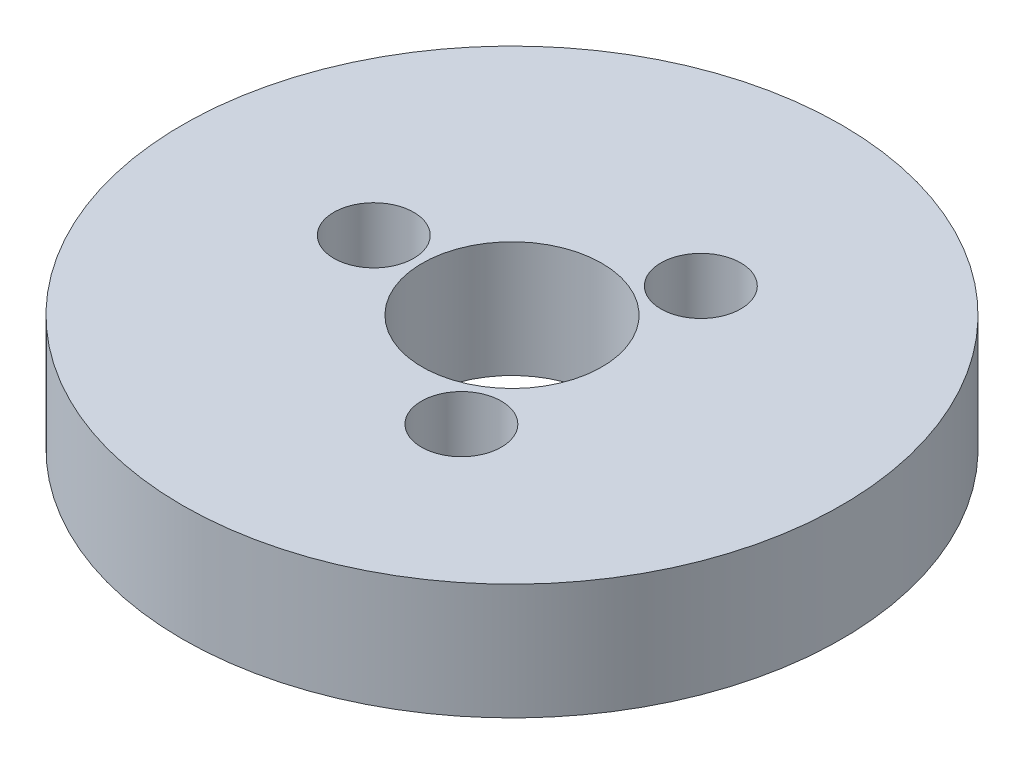
ISO-10303-21;
HEADER;
FILE_DESCRIPTION(('STEP AP214'),'2;1');
FILE_NAME('part.step','',(''),(''),'','','');
FILE_SCHEMA(('AUTOMOTIVE_DESIGN { 1 0 10303 214 1 1 1 1 }'));
ENDSEC;
DATA;
#1=APPLICATION_CONTEXT('core data for automotive mechanical design processes');
#2=APPLICATION_PROTOCOL_DEFINITION('international standard','automotive_design',2000,#1);
#3=PRODUCT_CONTEXT('',#1,'mechanical');
#4=PRODUCT('Part','Part','',(#3));
#5=PRODUCT_RELATED_PRODUCT_CATEGORY('part','',(#4));
#6=PRODUCT_DEFINITION_FORMATION('','',#4);
#7=PRODUCT_DEFINITION_CONTEXT('part definition',#1,'design');
#8=PRODUCT_DEFINITION('design','',#6,#7);
#9=PRODUCT_DEFINITION_SHAPE('','',#8);
#10=(LENGTH_UNIT() NAMED_UNIT(*) SI_UNIT(.MILLI.,.METRE.));
#11=(NAMED_UNIT(*) PLANE_ANGLE_UNIT() SI_UNIT($,.RADIAN.));
#12=(NAMED_UNIT(*) SI_UNIT($,.STERADIAN.) SOLID_ANGLE_UNIT());
#13=UNCERTAINTY_MEASURE_WITH_UNIT(LENGTH_MEASURE(1.E-05),#10,'distance_accuracy_value','');
#14=(GEOMETRIC_REPRESENTATION_CONTEXT(3) GLOBAL_UNCERTAINTY_ASSIGNED_CONTEXT((#13)) GLOBAL_UNIT_ASSIGNED_CONTEXT((#10,
#11,#12)) REPRESENTATION_CONTEXT('',''));
#15=CARTESIAN_POINT('',(0.,0.,0.));
#16=DIRECTION('',(0.,0.,1.));
#17=DIRECTION('',(1.,0.,0.));
#18=AXIS2_PLACEMENT_3D('',#15,#16,#17);
#19=CARTESIAN_POINT('',(0.,29.,0.));
#20=DIRECTION('',(0.,-1.,0.));
#21=DIRECTION('',(0.,0.,-1.));
#22=AXIS2_PLACEMENT_3D('',#19,#20,#21);
#23=CYLINDRICAL_SURFACE('',#22,82.5);
#24=CARTESIAN_POINT('',(0.,29.,0.));
#25=DIRECTION('',(0.,1.,0.));
#26=DIRECTION('',(0.,0.,1.));
#27=AXIS2_PLACEMENT_3D('',#24,#25,#26);
#28=CIRCLE('',#27,82.5);
#29=CARTESIAN_POINT('',(0.,29.,-82.5));
#30=VERTEX_POINT('',#29);
#31=EDGE_CURVE('E10',#30,#30,#28,.T.);
#32=CARTESIAN_POINT('',(0.,0.,0.));
#33=DIRECTION('',(0.,1.,0.));
#34=DIRECTION('',(0.,0.,1.));
#35=AXIS2_PLACEMENT_3D('',#32,#33,#34);
#36=CIRCLE('',#35,82.5);
#37=CARTESIAN_POINT('',(0.,0.,-82.5));
#38=VERTEX_POINT('',#37);
#39=EDGE_CURVE('E37',#38,#38,#36,.T.);
#40=CARTESIAN_POINT('',(0.,29.,-82.5));
#41=CARTESIAN_POINT('',(0.,28.6979166666667,-82.5));
#42=CARTESIAN_POINT('',(0.,28.3958333333333,-82.5));
#43=CARTESIAN_POINT('',(0.,27.7916666666667,-82.5));
#44=CARTESIAN_POINT('',(0.,27.4895833333333,-82.5));
#45=CARTESIAN_POINT('',(0.,26.8854166666667,-82.5));
#46=CARTESIAN_POINT('',(0.,26.5833333333333,-82.5));
#47=CARTESIAN_POINT('',(0.,25.9791666666667,-82.5));
#48=CARTESIAN_POINT('',(0.,25.6770833333333,-82.5));
#49=CARTESIAN_POINT('',(0.,25.0729166666667,-82.5));
#50=CARTESIAN_POINT('',(0.,24.7708333333333,-82.5));
#51=CARTESIAN_POINT('',(0.,24.1666666666667,-82.5));
#52=CARTESIAN_POINT('',(0.,23.8645833333333,-82.5));
#53=CARTESIAN_POINT('',(0.,23.2604166666667,-82.5));
#54=CARTESIAN_POINT('',(0.,22.9583333333333,-82.5));
#55=CARTESIAN_POINT('',(0.,22.3541666666667,-82.5));
#56=CARTESIAN_POINT('',(0.,22.0520833333333,-82.5));
#57=CARTESIAN_POINT('',(0.,21.4479166666667,-82.5));
#58=CARTESIAN_POINT('',(0.,21.1458333333333,-82.5));
#59=CARTESIAN_POINT('',(0.,20.5416666666667,-82.5));
#60=CARTESIAN_POINT('',(0.,20.2395833333333,-82.5));
#61=CARTESIAN_POINT('',(0.,19.6354166666667,-82.5));
#62=CARTESIAN_POINT('',(0.,19.3333333333333,-82.5));
#63=CARTESIAN_POINT('',(0.,18.7291666666667,-82.5));
#64=CARTESIAN_POINT('',(0.,18.4270833333333,-82.5));
#65=CARTESIAN_POINT('',(0.,17.8229166666667,-82.5));
#66=CARTESIAN_POINT('',(0.,17.5208333333333,-82.5));
#67=CARTESIAN_POINT('',(0.,16.9166666666667,-82.5));
#68=CARTESIAN_POINT('',(0.,16.6145833333333,-82.5));
#69=CARTESIAN_POINT('',(0.,16.0104166666667,-82.5));
#70=CARTESIAN_POINT('',(0.,15.7083333333333,-82.5));
#71=CARTESIAN_POINT('',(0.,15.1041666666667,-82.5));
#72=CARTESIAN_POINT('',(0.,14.8020833333333,-82.5));
#73=CARTESIAN_POINT('',(0.,14.1979166666667,-82.5));
#74=CARTESIAN_POINT('',(0.,13.8958333333333,-82.5));
#75=CARTESIAN_POINT('',(0.,13.2916666666667,-82.5));
#76=CARTESIAN_POINT('',(0.,12.9895833333333,-82.5));
#77=CARTESIAN_POINT('',(0.,12.3854166666667,-82.5));
#78=CARTESIAN_POINT('',(0.,12.0833333333333,-82.5));
#79=CARTESIAN_POINT('',(0.,11.4791666666667,-82.5));
#80=CARTESIAN_POINT('',(0.,11.1770833333333,-82.5));
#81=CARTESIAN_POINT('',(0.,10.5729166666667,-82.5));
#82=CARTESIAN_POINT('',(0.,10.2708333333333,-82.5));
#83=CARTESIAN_POINT('',(0.,9.66666666666667,-82.5));
#84=CARTESIAN_POINT('',(0.,9.36458333333333,-82.5));
#85=CARTESIAN_POINT('',(0.,8.76041666666667,-82.5));
#86=CARTESIAN_POINT('',(0.,8.45833333333333,-82.5));
#87=CARTESIAN_POINT('',(0.,7.85416666666667,-82.5));
#88=CARTESIAN_POINT('',(0.,7.55208333333333,-82.5));
#89=CARTESIAN_POINT('',(0.,6.94791666666667,-82.5));
#90=CARTESIAN_POINT('',(0.,6.64583333333333,-82.5));
#91=CARTESIAN_POINT('',(0.,6.04166666666667,-82.5));
#92=CARTESIAN_POINT('',(0.,5.73958333333333,-82.5));
#93=CARTESIAN_POINT('',(0.,5.13541666666667,-82.5));
#94=CARTESIAN_POINT('',(0.,4.83333333333333,-82.5));
#95=CARTESIAN_POINT('',(0.,4.22916666666667,-82.5));
#96=CARTESIAN_POINT('',(0.,3.92708333333333,-82.5));
#97=CARTESIAN_POINT('',(0.,3.32291666666667,-82.5));
#98=CARTESIAN_POINT('',(0.,3.02083333333333,-82.5));
#99=CARTESIAN_POINT('',(0.,2.41666666666667,-82.5));
#100=CARTESIAN_POINT('',(0.,2.11458333333333,-82.5));
#101=CARTESIAN_POINT('',(0.,1.51041666666667,-82.5));
#102=CARTESIAN_POINT('',(0.,1.20833333333333,-82.5));
#103=CARTESIAN_POINT('',(0.,0.604166666666667,-82.5));
#104=CARTESIAN_POINT('',(0.,0.302083333333333,-82.5));
#105=CARTESIAN_POINT('',(0.,0.,-82.5));
#106=B_SPLINE_CURVE_WITH_KNOTS('',3,(#40,#41,#42,#43,#44,#45,#46,#47,#48,#49,#50,#51,#52,#53,
#54,#55,#56,#57,#58,#59,#60,#61,#62,#63,#64,#65,#66,#67,#68,#69,#70,#71,#72,#73,#74,#75,#76,#77,
#78,#79,#80,#81,#82,#83,#84,#85,#86,#87,#88,#89,#90,#91,#92,#93,#94,#95,#96,#97,#98,#99,#100,
#101,#102,#103,#104,#105),.UNSPECIFIED.,.F.,.F.,(4,2,2,2,2,2,2,2,2,2,2,2,2,2,2,2,2,2,2,2,2,2,2,
2,2,2,2,2,2,2,2,2,4),(0.,0.906249999999997,1.8125,2.71875,3.625,4.53125,5.4375,6.34375,7.25,
8.15625,9.0625,9.96875,10.875,11.78125,12.6875,13.59375,14.5,15.40625,16.3125,17.21875,18.125,
19.03125,19.9375,20.84375,21.75,22.65625,23.5625,24.46875,25.375,26.28125,27.1875,28.09375,29.),.UNSPECIFIED.);
#107=EDGE_CURVE('BSEAM40',#30,#38,#106,.T.);
#108=ORIENTED_EDGE('',*,*,#31,.F.);
#109=ORIENTED_EDGE('',*,*,#39,.T.);
#110=ORIENTED_EDGE('',*,*,#107,.T.);
#111=ORIENTED_EDGE('',*,*,#107,.F.);
#112=EDGE_LOOP('',(#108,#110,#109,#111));
#113=FACE_BOUND('',#112,.T.);
#114=ADVANCED_FACE('F40',(#113),#23,.T.);
#115=CARTESIAN_POINT('',(0.,29.,0.));
#116=DIRECTION('',(0.,1.,0.));
#117=DIRECTION('',(0.,0.,1.));
#118=AXIS2_PLACEMENT_3D('',#115,#116,#117);
#119=PLANE('',#118);
#120=CARTESIAN_POINT('',(17.3025149694125,29.,29.9688350257433));
#121=DIRECTION('',(0.,1.,0.));
#122=DIRECTION('',(0.866025403784436,0.,-0.500000000000004));
#123=AXIS2_PLACEMENT_3D('',#120,#121,#122);
#124=CIRCLE('',#123,10.);
#125=CARTESIAN_POINT('',(25.9627690072569,29.,24.9688350257432));
#126=VERTEX_POINT('',#125);
#127=EDGE_CURVE('E70',#126,#126,#124,.T.);
#128=ORIENTED_EDGE('',*,*,#127,.F.);
#129=EDGE_LOOP('',(#128));
#130=FACE_BOUND('',#129,.T.);
#131=CARTESIAN_POINT('',(17.3025149694121,29.,-29.9688350257435));
#132=DIRECTION('',(0.,1.,0.));
#133=DIRECTION('',(-0.866025403784443,0.,-0.499999999999992));
#134=AXIS2_PLACEMENT_3D('',#131,#132,#133);
#135=CIRCLE('',#134,10.);
#136=CARTESIAN_POINT('',(8.64226093156769,29.,-34.9688350257434));
#137=VERTEX_POINT('',#136);
#138=EDGE_CURVE('E61',#137,#137,#135,.T.);
#139=ORIENTED_EDGE('',*,*,#138,.F.);
#140=EDGE_LOOP('',(#139));
#141=FACE_BOUND('',#140,.T.);
#142=CARTESIAN_POINT('',(-34.6050299388248,29.,0.));
#143=DIRECTION('',(0.,1.,0.));
#144=DIRECTION('',(0.,0.,1.));
#145=AXIS2_PLACEMENT_3D('',#142,#143,#144);
#146=CIRCLE('',#145,10.);
#147=CARTESIAN_POINT('',(-34.6050299388248,29.,10.));
#148=VERTEX_POINT('',#147);
#149=EDGE_CURVE('E54',#148,#148,#146,.T.);
#150=ORIENTED_EDGE('',*,*,#149,.F.);
#151=EDGE_LOOP('',(#150));
#152=FACE_BOUND('',#151,.T.);
#153=CARTESIAN_POINT('',(0.,29.,0.));
#154=DIRECTION('',(0.,1.,0.));
#155=DIRECTION('',(0.,0.,1.));
#156=AXIS2_PLACEMENT_3D('',#153,#154,#155);
#157=CIRCLE('',#156,22.5);
#158=CARTESIAN_POINT('',(0.,29.,-22.5));
#159=VERTEX_POINT('',#158);
#160=EDGE_CURVE('E50',#159,#159,#157,.T.);
#161=ORIENTED_EDGE('',*,*,#160,.F.);
#162=EDGE_LOOP('',(#161));
#163=FACE_BOUND('',#162,.T.);
#164=ORIENTED_EDGE('',*,*,#31,.T.);
#165=EDGE_LOOP('',(#164));
#166=FACE_BOUND('',#165,.T.);
#167=ADVANCED_FACE('F85',(#130,#141,#152,#163,#166),#119,.T.);
#168=CARTESIAN_POINT('',(0.,0.,0.));
#169=DIRECTION('',(0.,1.,0.));
#170=DIRECTION('',(0.,0.,1.));
#171=AXIS2_PLACEMENT_3D('',#168,#169,#170);
#172=PLANE('',#171);
#173=CARTESIAN_POINT('',(0.,0.,0.));
#174=DIRECTION('',(0.,1.,0.));
#175=DIRECTION('',(0.,0.,1.));
#176=AXIS2_PLACEMENT_3D('',#173,#174,#175);
#177=CIRCLE('',#176,22.5);
#178=CARTESIAN_POINT('',(0.,0.,-22.5));
#179=VERTEX_POINT('',#178);
#180=EDGE_CURVE('E47',#179,#179,#177,.T.);
#181=ORIENTED_EDGE('',*,*,#180,.T.);
#182=EDGE_LOOP('',(#181));
#183=FACE_BOUND('',#182,.T.);
#184=ORIENTED_EDGE('',*,*,#39,.F.);
#185=EDGE_LOOP('',(#184));
#186=FACE_BOUND('',#185,.T.);
#187=ADVANCED_FACE('F84',(#183,#186),#172,.F.);
#188=CARTESIAN_POINT('',(0.,29.,0.));
#189=DIRECTION('',(0.,-1.,0.));
#190=DIRECTION('',(0.,0.,-1.));
#191=AXIS2_PLACEMENT_3D('',#188,#189,#190);
#192=CYLINDRICAL_SURFACE('',#191,22.5);
#193=CARTESIAN_POINT('',(0.,29.,-22.5));
#194=CARTESIAN_POINT('',(0.,28.6979166666667,-22.5));
#195=CARTESIAN_POINT('',(0.,28.3958333333333,-22.5));
#196=CARTESIAN_POINT('',(0.,27.7916666666667,-22.5));
#197=CARTESIAN_POINT('',(0.,27.4895833333333,-22.5));
#198=CARTESIAN_POINT('',(0.,26.8854166666667,-22.5));
#199=CARTESIAN_POINT('',(0.,26.5833333333333,-22.5));
#200=CARTESIAN_POINT('',(0.,25.9791666666667,-22.5));
#201=CARTESIAN_POINT('',(0.,25.6770833333333,-22.5));
#202=CARTESIAN_POINT('',(0.,25.0729166666667,-22.5));
#203=CARTESIAN_POINT('',(0.,24.7708333333333,-22.5));
#204=CARTESIAN_POINT('',(0.,24.1666666666667,-22.5));
#205=CARTESIAN_POINT('',(0.,23.8645833333333,-22.5));
#206=CARTESIAN_POINT('',(0.,23.2604166666667,-22.5));
#207=CARTESIAN_POINT('',(0.,22.9583333333333,-22.5));
#208=CARTESIAN_POINT('',(0.,22.3541666666667,-22.5));
#209=CARTESIAN_POINT('',(0.,22.0520833333333,-22.5));
#210=CARTESIAN_POINT('',(0.,21.4479166666667,-22.5));
#211=CARTESIAN_POINT('',(0.,21.1458333333333,-22.5));
#212=CARTESIAN_POINT('',(0.,20.5416666666667,-22.5));
#213=CARTESIAN_POINT('',(0.,20.2395833333333,-22.5));
#214=CARTESIAN_POINT('',(0.,19.6354166666667,-22.5));
#215=CARTESIAN_POINT('',(0.,19.3333333333333,-22.5));
#216=CARTESIAN_POINT('',(0.,18.7291666666667,-22.5));
#217=CARTESIAN_POINT('',(0.,18.4270833333333,-22.5));
#218=CARTESIAN_POINT('',(0.,17.8229166666667,-22.5));
#219=CARTESIAN_POINT('',(0.,17.5208333333333,-22.5));
#220=CARTESIAN_POINT('',(0.,16.9166666666667,-22.5));
#221=CARTESIAN_POINT('',(0.,16.6145833333333,-22.5));
#222=CARTESIAN_POINT('',(0.,16.0104166666667,-22.5));
#223=CARTESIAN_POINT('',(0.,15.7083333333333,-22.5));
#224=CARTESIAN_POINT('',(0.,15.1041666666667,-22.5));
#225=CARTESIAN_POINT('',(0.,14.8020833333333,-22.5));
#226=CARTESIAN_POINT('',(0.,14.1979166666667,-22.5));
#227=CARTESIAN_POINT('',(0.,13.8958333333333,-22.5));
#228=CARTESIAN_POINT('',(0.,13.2916666666667,-22.5));
#229=CARTESIAN_POINT('',(0.,12.9895833333333,-22.5));
#230=CARTESIAN_POINT('',(0.,12.3854166666667,-22.5));
#231=CARTESIAN_POINT('',(0.,12.0833333333333,-22.5));
#232=CARTESIAN_POINT('',(0.,11.4791666666667,-22.5));
#233=CARTESIAN_POINT('',(0.,11.1770833333333,-22.5));
#234=CARTESIAN_POINT('',(0.,10.5729166666667,-22.5));
#235=CARTESIAN_POINT('',(0.,10.2708333333333,-22.5));
#236=CARTESIAN_POINT('',(0.,9.66666666666667,-22.5));
#237=CARTESIAN_POINT('',(0.,9.36458333333333,-22.5));
#238=CARTESIAN_POINT('',(0.,8.76041666666667,-22.5));
#239=CARTESIAN_POINT('',(0.,8.45833333333333,-22.5));
#240=CARTESIAN_POINT('',(0.,7.85416666666667,-22.5));
#241=CARTESIAN_POINT('',(0.,7.55208333333333,-22.5));
#242=CARTESIAN_POINT('',(0.,6.94791666666667,-22.5));
#243=CARTESIAN_POINT('',(0.,6.64583333333333,-22.5));
#244=CARTESIAN_POINT('',(0.,6.04166666666667,-22.5));
#245=CARTESIAN_POINT('',(0.,5.73958333333333,-22.5));
#246=CARTESIAN_POINT('',(0.,5.13541666666667,-22.5));
#247=CARTESIAN_POINT('',(0.,4.83333333333333,-22.5));
#248=CARTESIAN_POINT('',(0.,4.22916666666667,-22.5));
#249=CARTESIAN_POINT('',(0.,3.92708333333333,-22.5));
#250=CARTESIAN_POINT('',(0.,3.32291666666667,-22.5));
#251=CARTESIAN_POINT('',(0.,3.02083333333333,-22.5));
#252=CARTESIAN_POINT('',(0.,2.41666666666667,-22.5));
#253=CARTESIAN_POINT('',(0.,2.11458333333333,-22.5));
#254=CARTESIAN_POINT('',(0.,1.51041666666667,-22.5));
#255=CARTESIAN_POINT('',(0.,1.20833333333333,-22.5));
#256=CARTESIAN_POINT('',(0.,0.604166666666667,-22.5));
#257=CARTESIAN_POINT('',(0.,0.302083333333333,-22.5));
#258=CARTESIAN_POINT('',(0.,0.,-22.5));
#259=B_SPLINE_CURVE_WITH_KNOTS('',3,(#193,#194,#195,#196,#197,#198,#199,#200,#201,#202,#203,
#204,#205,#206,#207,#208,#209,#210,#211,#212,#213,#214,#215,#216,#217,#218,#219,#220,#221,#222,
#223,#224,#225,#226,#227,#228,#229,#230,#231,#232,#233,#234,#235,#236,#237,#238,#239,#240,#241,
#242,#243,#244,#245,#246,#247,#248,#249,#250,#251,#252,#253,#254,#255,#256,#257,#258),
.UNSPECIFIED.,.F.,.F.,(4,2,2,2,2,2,2,2,2,2,2,2,2,2,2,2,2,2,2,2,2,2,2,2,2,2,2,2,2,2,2,2,4),(0.,
0.906249999999997,1.8125,2.71875,3.625,4.53125,5.4375,6.34375,7.25,8.15625,9.0625,9.96875,
10.875,11.78125,12.6875,13.59375,14.5,15.40625,16.3125,17.21875,18.125,19.03125,19.9375,
20.84375,21.75,22.65625,23.5625,24.46875,25.375,26.28125,27.1875,28.09375,29.),.UNSPECIFIED.);
#260=EDGE_CURVE('BSEAM91',#159,#179,#259,.T.);
#261=ORIENTED_EDGE('',*,*,#160,.T.);
#262=ORIENTED_EDGE('',*,*,#180,.F.);
#263=ORIENTED_EDGE('',*,*,#260,.T.);
#264=ORIENTED_EDGE('',*,*,#260,.F.);
#265=EDGE_LOOP('',(#261,#263,#262,#264));
#266=FACE_BOUND('',#265,.T.);
#267=ADVANCED_FACE('F91',(#266),#192,.F.);
#268=CARTESIAN_POINT('',(-34.6050299388248,9.10236871501353,0.));
#269=DIRECTION('',(0.,1.,0.));
#270=DIRECTION('',(0.,0.,1.));
#271=AXIS2_PLACEMENT_3D('',#268,#269,#270);
#272=CYLINDRICAL_SURFACE('',#271,10.);
#273=CARTESIAN_POINT('',(-34.6050299388248,9.10236871501353,0.));
#274=DIRECTION('',(0.,1.,0.));
#275=DIRECTION('',(0.,0.,1.));
#276=AXIS2_PLACEMENT_3D('',#273,#274,#275);
#277=CIRCLE('',#276,10.);
#278=CARTESIAN_POINT('',(-34.6050299388248,9.10236871501353,10.));
#279=VERTEX_POINT('',#278);
#280=EDGE_CURVE('E55',#279,#279,#277,.T.);
#281=ORIENTED_EDGE('',*,*,#280,.F.);
#282=EDGE_LOOP('',(#281));
#283=FACE_BOUND('',#282,.T.);
#284=ORIENTED_EDGE('',*,*,#149,.T.);
#285=EDGE_LOOP('',(#284));
#286=FACE_BOUND('',#285,.T.);
#287=ADVANCED_FACE('F96',(#283,#286),#272,.F.);
#288=CARTESIAN_POINT('',(-34.6050299388248,9.10236871501353,0.));
#289=DIRECTION('',(0.,1.,0.));
#290=DIRECTION('',(0.,0.,1.));
#291=AXIS2_PLACEMENT_3D('',#288,#289,#290);
#292=PLANE('',#291);
#293=ORIENTED_EDGE('',*,*,#280,.T.);
#294=EDGE_LOOP('',(#293));
#295=FACE_BOUND('',#294,.T.);
#296=ADVANCED_FACE('F127',(#295),#292,.T.);
#297=CARTESIAN_POINT('',(17.3025149694121,9.10236871501353,-29.9688350257435));
#298=DIRECTION('',(0.,1.,0.));
#299=DIRECTION('',(0.,0.,1.));
#300=AXIS2_PLACEMENT_3D('',#297,#298,#299);
#301=CYLINDRICAL_SURFACE('',#300,10.);
#302=CARTESIAN_POINT('',(17.3025149694121,9.10236871501353,-29.9688350257435));
#303=DIRECTION('',(0.,1.,0.));
#304=DIRECTION('',(-0.866025403784443,0.,-0.499999999999992));
#305=AXIS2_PLACEMENT_3D('',#302,#303,#304);
#306=CIRCLE('',#305,10.);
#307=CARTESIAN_POINT('',(8.64226093156769,9.10236871501353,-34.9688350257434));
#308=VERTEX_POINT('',#307);
#309=EDGE_CURVE('E63',#308,#308,#306,.T.);
#310=ORIENTED_EDGE('',*,*,#309,.F.);
#311=EDGE_LOOP('',(#310));
#312=FACE_BOUND('',#311,.T.);
#313=ORIENTED_EDGE('',*,*,#138,.T.);
#314=EDGE_LOOP('',(#313));
#315=FACE_BOUND('',#314,.T.);
#316=ADVANCED_FACE('F133',(#312,#315),#301,.F.);
#317=CARTESIAN_POINT('',(17.3025149694121,9.10236871501353,-29.9688350257435));
#318=DIRECTION('',(0.,1.,0.));
#319=DIRECTION('',(-0.866025403784443,0.,-0.499999999999992));
#320=AXIS2_PLACEMENT_3D('',#317,#318,#319);
#321=PLANE('',#320);
#322=ORIENTED_EDGE('',*,*,#309,.T.);
#323=EDGE_LOOP('',(#322));
#324=FACE_BOUND('',#323,.T.);
#325=ADVANCED_FACE('F77',(#324),#321,.T.);
#326=CARTESIAN_POINT('',(17.3025149694125,9.10236871501353,29.9688350257433));
#327=DIRECTION('',(0.,1.,0.));
#328=DIRECTION('',(0.,0.,1.));
#329=AXIS2_PLACEMENT_3D('',#326,#327,#328);
#330=CYLINDRICAL_SURFACE('',#329,10.);
#331=CARTESIAN_POINT('',(17.3025149694125,9.10236871501353,29.9688350257433));
#332=DIRECTION('',(0.,1.,0.));
#333=DIRECTION('',(0.866025403784436,0.,-0.500000000000004));
#334=AXIS2_PLACEMENT_3D('',#331,#332,#333);
#335=CIRCLE('',#334,10.);
#336=CARTESIAN_POINT('',(25.9627690072569,9.10236871501353,24.9688350257432));
#337=VERTEX_POINT('',#336);
#338=EDGE_CURVE('E59',#337,#337,#335,.T.);
#339=ORIENTED_EDGE('',*,*,#338,.F.);
#340=EDGE_LOOP('',(#339));
#341=FACE_BOUND('',#340,.T.);
#342=ORIENTED_EDGE('',*,*,#127,.T.);
#343=EDGE_LOOP('',(#342));
#344=FACE_BOUND('',#343,.T.);
#345=ADVANCED_FACE('F73',(#341,#344),#330,.F.);
#346=CARTESIAN_POINT('',(17.3025149694125,9.10236871501353,29.9688350257433));
#347=DIRECTION('',(0.,1.,0.));
#348=DIRECTION('',(0.866025403784436,0.,-0.500000000000004));
#349=AXIS2_PLACEMENT_3D('',#346,#347,#348);
#350=PLANE('',#349);
#351=ORIENTED_EDGE('',*,*,#338,.T.);
#352=EDGE_LOOP('',(#351));
#353=FACE_BOUND('',#352,.T.);
#354=ADVANCED_FACE('F71',(#353),#350,.T.);
#355=CLOSED_SHELL('',(#114,#167,#187,#267,#287,#296,#316,#325,#345,#354));
#356=MANIFOLD_SOLID_BREP('B2',#355);
#357=ADVANCED_BREP_SHAPE_REPRESENTATION('',(#18,#356),#14);
#358=SHAPE_DEFINITION_REPRESENTATION(#9,#357);
ENDSEC;
END-ISO-10303-21;
